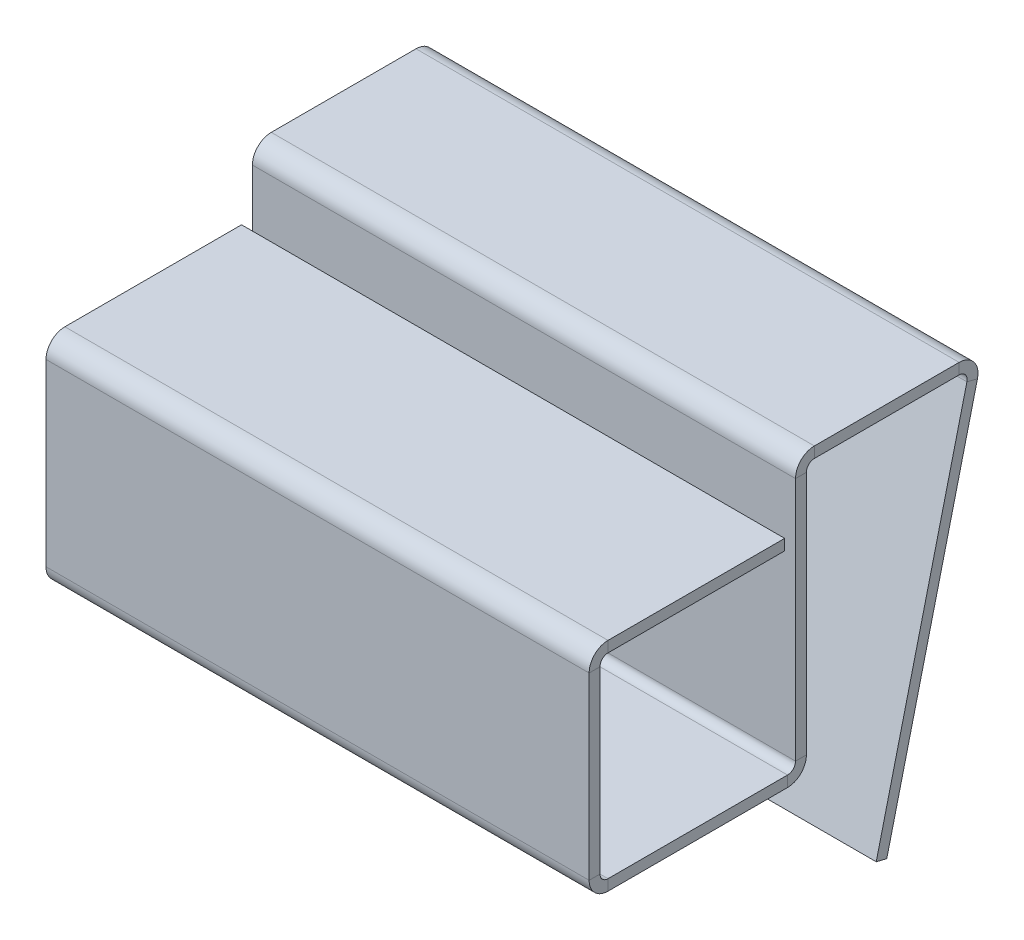
ISO-10303-21;
HEADER;
FILE_DESCRIPTION(('STEP AP214'),'2;1');
FILE_NAME('part.step','',(''),(''),'','','');
FILE_SCHEMA(('AUTOMOTIVE_DESIGN { 1 0 10303 214 1 1 1 1 }'));
ENDSEC;
DATA;
#1=APPLICATION_CONTEXT('core data for automotive mechanical design processes');
#2=APPLICATION_PROTOCOL_DEFINITION('international standard','automotive_design',2000,#1);
#3=PRODUCT_CONTEXT('',#1,'mechanical');
#4=PRODUCT('Part','Part','',(#3));
#5=PRODUCT_RELATED_PRODUCT_CATEGORY('part','',(#4));
#6=PRODUCT_DEFINITION_FORMATION('','',#4);
#7=PRODUCT_DEFINITION_CONTEXT('part definition',#1,'design');
#8=PRODUCT_DEFINITION('design','',#6,#7);
#9=PRODUCT_DEFINITION_SHAPE('','',#8);
#10=(LENGTH_UNIT() NAMED_UNIT(*) SI_UNIT(.MILLI.,.METRE.));
#11=(NAMED_UNIT(*) PLANE_ANGLE_UNIT() SI_UNIT($,.RADIAN.));
#12=(NAMED_UNIT(*) SI_UNIT($,.STERADIAN.) SOLID_ANGLE_UNIT());
#13=UNCERTAINTY_MEASURE_WITH_UNIT(LENGTH_MEASURE(1.E-05),#10,'distance_accuracy_value','');
#14=(GEOMETRIC_REPRESENTATION_CONTEXT(3) GLOBAL_UNCERTAINTY_ASSIGNED_CONTEXT((#13)) GLOBAL_UNIT_ASSIGNED_CONTEXT((#10,
#11,#12)) REPRESENTATION_CONTEXT('',''));
#15=CARTESIAN_POINT('',(0.,0.,0.));
#16=DIRECTION('',(0.,0.,1.));
#17=DIRECTION('',(1.,0.,0.));
#18=AXIS2_PLACEMENT_3D('',#15,#16,#17);
#19=CARTESIAN_POINT('',(50.,35.,-7.6326695579513));
#20=DIRECTION('',(1.,0.,0.));
#21=DIRECTION('',(0.,0.,-1.));
#22=AXIS2_PLACEMENT_3D('',#19,#20,#21);
#23=PLANE('',#22);
#24=DIRECTION('',(0.,1.,0.));
#25=VECTOR('',#24,1.);
#26=CARTESIAN_POINT('',(50.,35.,-7.6326695579513));
#27=LINE('',#26,#25);
#28=CARTESIAN_POINT('',(50.,35.,-7.6326695579513));
#29=VERTEX_POINT('',#28);
#30=CARTESIAN_POINT('',(50.,36.,-7.6326695579513));
#31=VERTEX_POINT('',#30);
#32=EDGE_CURVE('E11',#29,#31,#27,.T.);
#33=ORIENTED_EDGE('',*,*,#32,.F.);
#34=CARTESIAN_POINT('',(50.,34.2634,-7.6326695579513));
#35=DIRECTION('',(-1.,0.,0.));
#36=DIRECTION('',(0.,0.,1.));
#37=AXIS2_PLACEMENT_3D('',#34,#35,#36);
#38=CIRCLE('',#37,0.7366);
#39=CARTESIAN_POINT('',(50.,34.0881858939392,-8.34812715769941));
#40=VERTEX_POINT('',#39);
#41=EDGE_CURVE('E421',#40,#29,#38,.F.);
#42=ORIENTED_EDGE('',*,*,#41,.F.);
#43=DIRECTION('',(0.,0.237868729379253,0.971297311631974));
#44=VECTOR('',#43,1.);
#45=CARTESIAN_POINT('',(50.,33.85031716456,-9.31942446933138));
#46=LINE('',#45,#44);
#47=CARTESIAN_POINT('',(50.,33.85031716456,-9.31942446933138));
#48=VERTEX_POINT('',#47);
#49=EDGE_CURVE('E44',#48,#40,#46,.T.);
#50=ORIENTED_EDGE('',*,*,#49,.F.);
#51=CARTESIAN_POINT('',(50.,34.2634,-7.6326695579513));
#52=DIRECTION('',(1.,0.,0.));
#53=DIRECTION('',(0.,0.,-1.));
#54=AXIS2_PLACEMENT_3D('',#51,#52,#53);
#55=CIRCLE('',#54,1.7366);
#56=EDGE_CURVE('E434',#48,#31,#55,.T.);
#57=ORIENTED_EDGE('',*,*,#56,.T.);
#58=EDGE_LOOP('',(#33,#42,#50,#57));
#59=FACE_BOUND('',#58,.T.);
#60=ADVANCED_FACE('F36',(#59),#23,.T.);
#61=CARTESIAN_POINT('',(50.,33.85031716456,-9.31942446933138));
#62=DIRECTION('',(1.,0.,0.));
#63=DIRECTION('',(0.,0.,-1.));
#64=AXIS2_PLACEMENT_3D('',#61,#62,#63);
#65=PLANE('',#64);
#66=DIRECTION('',(0.,0.,1.));
#67=VECTOR('',#66,1.);
#68=CARTESIAN_POINT('',(50.,35.,-8.57142857142857));
#69=LINE('',#68,#67);
#70=CARTESIAN_POINT('',(50.,35.,5.69197142857143));
#71=VERTEX_POINT('',#70);
#72=EDGE_CURVE('E425',#29,#71,#69,.T.);
#73=ORIENTED_EDGE('',*,*,#72,.F.);
#74=ORIENTED_EDGE('',*,*,#32,.T.);
#75=DIRECTION('',(0.,0.,-1.));
#76=VECTOR('',#75,1.);
#77=CARTESIAN_POINT('',(50.,36.,-8.57142857142857));
#78=LINE('',#77,#76);
#79=CARTESIAN_POINT('',(50.,36.,5.69197142857143));
#80=VERTEX_POINT('',#79);
#81=EDGE_CURVE('E436',#31,#80,#78,.F.);
#82=ORIENTED_EDGE('',*,*,#81,.T.);
#83=DIRECTION('',(0.,-1.,0.));
#84=VECTOR('',#83,1.);
#85=CARTESIAN_POINT('',(50.,36.,5.69197142857143));
#86=LINE('',#85,#84);
#87=EDGE_CURVE('E395',#80,#71,#86,.T.);
#88=ORIENTED_EDGE('',*,*,#87,.T.);
#89=EDGE_LOOP('',(#73,#74,#82,#88));
#90=FACE_BOUND('',#89,.T.);
#91=ADVANCED_FACE('F517',(#90),#65,.T.);
#92=CARTESIAN_POINT('',(0.,34.0881858939392,-8.34812715769941));
#93=DIRECTION('',(-1.,0.,0.));
#94=DIRECTION('',(0.,0.,1.));
#95=AXIS2_PLACEMENT_3D('',#92,#93,#94);
#96=PLANE('',#95);
#97=DIRECTION('',(0.,-0.237868729379253,-0.971297311631974));
#98=VECTOR('',#97,1.);
#99=CARTESIAN_POINT('',(0.,34.0881858939392,-8.34812715769941));
#100=LINE('',#99,#98);
#101=CARTESIAN_POINT('',(0.,34.0881858939392,-8.34812715769941));
#102=VERTEX_POINT('',#101);
#103=CARTESIAN_POINT('',(0.,33.85031716456,-9.31942446933138));
#104=VERTEX_POINT('',#103);
#105=EDGE_CURVE('E401',#102,#104,#100,.T.);
#106=ORIENTED_EDGE('',*,*,#105,.F.);
#107=CARTESIAN_POINT('',(0.,34.2634,-7.6326695579513));
#108=DIRECTION('',(-1.,0.,0.));
#109=DIRECTION('',(0.,0.,1.));
#110=AXIS2_PLACEMENT_3D('',#107,#108,#109);
#111=CIRCLE('',#110,0.7366);
#112=CARTESIAN_POINT('',(0.,35.,-7.6326695579513));
#113=VERTEX_POINT('',#112);
#114=EDGE_CURVE('E279',#102,#113,#111,.F.);
#115=ORIENTED_EDGE('',*,*,#114,.T.);
#116=DIRECTION('',(0.,-1.,0.));
#117=VECTOR('',#116,1.);
#118=CARTESIAN_POINT('',(0.,36.,-7.6326695579513));
#119=LINE('',#118,#117);
#120=CARTESIAN_POINT('',(0.,36.,-7.6326695579513));
#121=VERTEX_POINT('',#120);
#122=EDGE_CURVE('E399',#121,#113,#119,.T.);
#123=ORIENTED_EDGE('',*,*,#122,.F.);
#124=CARTESIAN_POINT('',(0.,34.2634,-7.6326695579513));
#125=DIRECTION('',(1.,0.,0.));
#126=DIRECTION('',(0.,0.,-1.));
#127=AXIS2_PLACEMENT_3D('',#124,#125,#126);
#128=CIRCLE('',#127,1.7366);
#129=EDGE_CURVE('E291',#104,#121,#128,.T.);
#130=ORIENTED_EDGE('',*,*,#129,.F.);
#131=EDGE_LOOP('',(#106,#115,#123,#130));
#132=FACE_BOUND('',#131,.T.);
#133=ADVANCED_FACE('F576',(#132),#96,.T.);
#134=CARTESIAN_POINT('',(0.,36.,-7.6326695579513));
#135=DIRECTION('',(-1.,0.,0.));
#136=DIRECTION('',(0.,0.,1.));
#137=AXIS2_PLACEMENT_3D('',#134,#135,#136);
#138=PLANE('',#137);
#139=DIRECTION('',(0.,0.971297311631973,-0.237868729379259));
#140=VECTOR('',#139,1.);
#141=CARTESIAN_POINT('',(0.,0.,0.));
#142=LINE('',#141,#140);
#143=CARTESIAN_POINT('',(0.,0.,0.));
#144=VERTEX_POINT('',#143);
#145=EDGE_CURVE('E282',#144,#102,#142,.T.);
#146=ORIENTED_EDGE('',*,*,#145,.T.);
#147=ORIENTED_EDGE('',*,*,#105,.T.);
#148=DIRECTION('',(0.,0.971297311631973,-0.237868729379259));
#149=VECTOR('',#148,1.);
#150=CARTESIAN_POINT('',(0.,-0.237868729379259,-0.971297311631973));
#151=LINE('',#150,#149);
#152=CARTESIAN_POINT('',(0.,-0.237868729379259,-0.971297311631973));
#153=VERTEX_POINT('',#152);
#154=EDGE_CURVE('E288',#153,#104,#151,.T.);
#155=ORIENTED_EDGE('',*,*,#154,.F.);
#156=DIRECTION('',(0.,0.237868729379259,0.971297311631973));
#157=VECTOR('',#156,1.);
#158=CARTESIAN_POINT('',(0.,-0.237868729379259,-0.971297311631973));
#159=LINE('',#158,#157);
#160=EDGE_CURVE('E285',#153,#144,#159,.T.);
#161=ORIENTED_EDGE('',*,*,#160,.T.);
#162=EDGE_LOOP('',(#146,#147,#155,#161));
#163=FACE_BOUND('',#162,.T.);
#164=ADVANCED_FACE('F580',(#163),#138,.T.);
#165=CARTESIAN_POINT('',(50.,34.2634,6.42857142857143));
#166=DIRECTION('',(1.,0.,0.));
#167=DIRECTION('',(0.,0.,-1.));
#168=AXIS2_PLACEMENT_3D('',#165,#166,#167);
#169=PLANE('',#168);
#170=DIRECTION('',(0.,0.,1.));
#171=VECTOR('',#170,1.);
#172=CARTESIAN_POINT('',(50.,34.2634,6.42857142857143));
#173=LINE('',#172,#171);
#174=CARTESIAN_POINT('',(50.,34.2634,6.42857142857143));
#175=VERTEX_POINT('',#174);
#176=CARTESIAN_POINT('',(50.,34.2634,7.42857142857143));
#177=VERTEX_POINT('',#176);
#178=EDGE_CURVE('E397',#175,#177,#173,.T.);
#179=ORIENTED_EDGE('',*,*,#178,.F.);
#180=CARTESIAN_POINT('',(50.,34.2634,5.69197142857143));
#181=DIRECTION('',(-1.,0.,0.));
#182=DIRECTION('',(0.,0.,1.));
#183=AXIS2_PLACEMENT_3D('',#180,#181,#182);
#184=CIRCLE('',#183,0.7366);
#185=EDGE_CURVE('E507',#71,#175,#184,.F.);
#186=ORIENTED_EDGE('',*,*,#185,.F.);
#187=ORIENTED_EDGE('',*,*,#87,.F.);
#188=CARTESIAN_POINT('',(50.,34.2634,5.69197142857143));
#189=DIRECTION('',(1.,0.,0.));
#190=DIRECTION('',(0.,0.,-1.));
#191=AXIS2_PLACEMENT_3D('',#188,#189,#190);
#192=CIRCLE('',#191,1.7366);
#193=EDGE_CURVE('E439',#80,#177,#192,.T.);
#194=ORIENTED_EDGE('',*,*,#193,.T.);
#195=EDGE_LOOP('',(#179,#186,#187,#194));
#196=FACE_BOUND('',#195,.T.);
#197=ADVANCED_FACE('F524',(#196),#169,.T.);
#198=CARTESIAN_POINT('',(50.,36.,5.69197142857143));
#199=DIRECTION('',(1.,0.,0.));
#200=DIRECTION('',(0.,0.,-1.));
#201=AXIS2_PLACEMENT_3D('',#198,#199,#200);
#202=PLANE('',#201);
#203=DIRECTION('',(0.,-1.,0.));
#204=VECTOR('',#203,1.);
#205=CARTESIAN_POINT('',(50.,35.,6.42857142857143));
#206=LINE('',#205,#204);
#207=CARTESIAN_POINT('',(50.,11.7366,6.42857142857142));
#208=VERTEX_POINT('',#207);
#209=EDGE_CURVE('E504',#175,#208,#206,.T.);
#210=ORIENTED_EDGE('',*,*,#209,.F.);
#211=ORIENTED_EDGE('',*,*,#178,.T.);
#212=DIRECTION('',(0.,-1.,0.));
#213=VECTOR('',#212,1.);
#214=CARTESIAN_POINT('',(50.,35.,7.42857142857143));
#215=LINE('',#214,#213);
#216=CARTESIAN_POINT('',(50.,11.7366,7.42857142857142));
#217=VERTEX_POINT('',#216);
#218=EDGE_CURVE('E442',#177,#217,#215,.T.);
#219=ORIENTED_EDGE('',*,*,#218,.T.);
#220=DIRECTION('',(0.,0.,-1.));
#221=VECTOR('',#220,1.);
#222=CARTESIAN_POINT('',(50.,11.7366,7.42857142857142));
#223=LINE('',#222,#221);
#224=EDGE_CURVE('E387',#217,#208,#223,.T.);
#225=ORIENTED_EDGE('',*,*,#224,.T.);
#226=EDGE_LOOP('',(#210,#211,#219,#225));
#227=FACE_BOUND('',#226,.T.);
#228=ADVANCED_FACE('F533',(#227),#202,.T.);
#229=CARTESIAN_POINT('',(0.,35.,5.69197142857143));
#230=DIRECTION('',(-1.,0.,0.));
#231=DIRECTION('',(0.,0.,1.));
#232=AXIS2_PLACEMENT_3D('',#229,#230,#231);
#233=PLANE('',#232);
#234=DIRECTION('',(0.,1.,0.));
#235=VECTOR('',#234,1.);
#236=CARTESIAN_POINT('',(0.,35.,5.69197142857143));
#237=LINE('',#236,#235);
#238=CARTESIAN_POINT('',(0.,35.,5.69197142857143));
#239=VERTEX_POINT('',#238);
#240=CARTESIAN_POINT('',(0.,36.,5.69197142857143));
#241=VERTEX_POINT('',#240);
#242=EDGE_CURVE('E393',#239,#241,#237,.T.);
#243=ORIENTED_EDGE('',*,*,#242,.F.);
#244=CARTESIAN_POINT('',(0.,34.2634,5.69197142857143));
#245=DIRECTION('',(-1.,0.,0.));
#246=DIRECTION('',(0.,0.,1.));
#247=AXIS2_PLACEMENT_3D('',#244,#245,#246);
#248=CIRCLE('',#247,0.7366);
#249=CARTESIAN_POINT('',(0.,34.2634,6.42857142857143));
#250=VERTEX_POINT('',#249);
#251=EDGE_CURVE('E273',#239,#250,#248,.F.);
#252=ORIENTED_EDGE('',*,*,#251,.T.);
#253=DIRECTION('',(0.,0.,-1.));
#254=VECTOR('',#253,1.);
#255=CARTESIAN_POINT('',(0.,34.2634,7.42857142857143));
#256=LINE('',#255,#254);
#257=CARTESIAN_POINT('',(0.,34.2634,7.42857142857143));
#258=VERTEX_POINT('',#257);
#259=EDGE_CURVE('E391',#258,#250,#256,.T.);
#260=ORIENTED_EDGE('',*,*,#259,.F.);
#261=CARTESIAN_POINT('',(0.,34.2634,5.69197142857143));
#262=DIRECTION('',(1.,0.,0.));
#263=DIRECTION('',(0.,0.,-1.));
#264=AXIS2_PLACEMENT_3D('',#261,#262,#263);
#265=CIRCLE('',#264,1.7366);
#266=EDGE_CURVE('E297',#241,#258,#265,.T.);
#267=ORIENTED_EDGE('',*,*,#266,.F.);
#268=EDGE_LOOP('',(#243,#252,#260,#267));
#269=FACE_BOUND('',#268,.T.);
#270=ADVANCED_FACE('F591',(#269),#233,.T.);
#271=CARTESIAN_POINT('',(0.,34.2634,7.42857142857143));
#272=DIRECTION('',(-1.,0.,0.));
#273=DIRECTION('',(0.,0.,1.));
#274=AXIS2_PLACEMENT_3D('',#271,#272,#273);
#275=PLANE('',#274);
#276=DIRECTION('',(0.,0.,1.));
#277=VECTOR('',#276,1.);
#278=CARTESIAN_POINT('',(0.,35.,-8.57142857142857));
#279=LINE('',#278,#277);
#280=EDGE_CURVE('E276',#113,#239,#279,.T.);
#281=ORIENTED_EDGE('',*,*,#280,.T.);
#282=ORIENTED_EDGE('',*,*,#242,.T.);
#283=DIRECTION('',(0.,0.,-1.));
#284=VECTOR('',#283,1.);
#285=CARTESIAN_POINT('',(0.,36.,-8.57142857142857));
#286=LINE('',#285,#284);
#287=EDGE_CURVE('E294',#121,#241,#286,.F.);
#288=ORIENTED_EDGE('',*,*,#287,.F.);
#289=ORIENTED_EDGE('',*,*,#122,.T.);
#290=EDGE_LOOP('',(#281,#282,#288,#289));
#291=FACE_BOUND('',#290,.T.);
#292=ADVANCED_FACE('F594',(#291),#275,.T.);
#293=CARTESIAN_POINT('',(50.,10.,8.16517142857142));
#294=DIRECTION('',(1.,0.,0.));
#295=DIRECTION('',(0.,0.,-1.));
#296=AXIS2_PLACEMENT_3D('',#293,#294,#295);
#297=PLANE('',#296);
#298=DIRECTION('',(0.,1.,0.));
#299=VECTOR('',#298,1.);
#300=CARTESIAN_POINT('',(50.,10.,8.16517142857142));
#301=LINE('',#300,#299);
#302=CARTESIAN_POINT('',(50.,10.,8.16517142857142));
#303=VERTEX_POINT('',#302);
#304=CARTESIAN_POINT('',(50.,11.,8.16517142857142));
#305=VERTEX_POINT('',#304);
#306=EDGE_CURVE('E389',#303,#305,#301,.T.);
#307=ORIENTED_EDGE('',*,*,#306,.F.);
#308=CARTESIAN_POINT('',(50.,11.7366,8.16517142857142));
#309=DIRECTION('',(1.,0.,0.));
#310=DIRECTION('',(0.,0.,-1.));
#311=AXIS2_PLACEMENT_3D('',#308,#309,#310);
#312=CIRCLE('',#311,1.7366);
#313=EDGE_CURVE('E501',#208,#303,#312,.F.);
#314=ORIENTED_EDGE('',*,*,#313,.F.);
#315=ORIENTED_EDGE('',*,*,#224,.F.);
#316=CARTESIAN_POINT('',(50.,11.7366,8.16517142857142));
#317=DIRECTION('',(1.,0.,0.));
#318=DIRECTION('',(0.,0.,-1.));
#319=AXIS2_PLACEMENT_3D('',#316,#317,#318);
#320=CIRCLE('',#319,0.7366);
#321=EDGE_CURVE('E445',#217,#305,#320,.F.);
#322=ORIENTED_EDGE('',*,*,#321,.T.);
#323=EDGE_LOOP('',(#307,#314,#315,#322));
#324=FACE_BOUND('',#323,.T.);
#325=ADVANCED_FACE('F542',(#324),#297,.T.);
#326=CARTESIAN_POINT('',(50.,11.7366,7.42857142857142));
#327=DIRECTION('',(1.,0.,0.));
#328=DIRECTION('',(0.,0.,-1.));
#329=AXIS2_PLACEMENT_3D('',#326,#327,#328);
#330=PLANE('',#329);
#331=DIRECTION('',(0.,0.,1.));
#332=VECTOR('',#331,1.);
#333=CARTESIAN_POINT('',(50.,10.,6.42857142857142));
#334=LINE('',#333,#332);
#335=CARTESIAN_POINT('',(50.,10.,24.6919714285714));
#336=VERTEX_POINT('',#335);
#337=EDGE_CURVE('E498',#303,#336,#334,.T.);
#338=ORIENTED_EDGE('',*,*,#337,.F.);
#339=ORIENTED_EDGE('',*,*,#306,.T.);
#340=DIRECTION('',(0.,0.,1.));
#341=VECTOR('',#340,1.);
#342=CARTESIAN_POINT('',(50.,11.,6.42857142857142));
#343=LINE('',#342,#341);
#344=CARTESIAN_POINT('',(50.,11.,24.6919714285714));
#345=VERTEX_POINT('',#344);
#346=EDGE_CURVE('E227',#305,#345,#343,.T.);
#347=ORIENTED_EDGE('',*,*,#346,.T.);
#348=DIRECTION('',(0.,-1.,0.));
#349=VECTOR('',#348,1.);
#350=CARTESIAN_POINT('',(50.,11.,24.6919714285714));
#351=LINE('',#350,#349);
#352=EDGE_CURVE('E218',#345,#336,#351,.T.);
#353=ORIENTED_EDGE('',*,*,#352,.T.);
#354=EDGE_LOOP('',(#338,#339,#347,#353));
#355=FACE_BOUND('',#354,.T.);
#356=ADVANCED_FACE('F451',(#355),#330,.T.);
#357=CARTESIAN_POINT('',(0.,11.7366,6.42857142857142));
#358=DIRECTION('',(-1.,0.,0.));
#359=DIRECTION('',(0.,0.,1.));
#360=AXIS2_PLACEMENT_3D('',#357,#358,#359);
#361=PLANE('',#360);
#362=DIRECTION('',(0.,0.,1.));
#363=VECTOR('',#362,1.);
#364=CARTESIAN_POINT('',(0.,11.7366,6.42857142857142));
#365=LINE('',#364,#363);
#366=CARTESIAN_POINT('',(0.,11.7366,6.42857142857142));
#367=VERTEX_POINT('',#366);
#368=CARTESIAN_POINT('',(0.,11.7366,7.42857142857142));
#369=VERTEX_POINT('',#368);
#370=EDGE_CURVE('E385',#367,#369,#365,.T.);
#371=ORIENTED_EDGE('',*,*,#370,.F.);
#372=CARTESIAN_POINT('',(0.,11.7366,8.16517142857142));
#373=DIRECTION('',(1.,0.,0.));
#374=DIRECTION('',(0.,0.,-1.));
#375=AXIS2_PLACEMENT_3D('',#372,#373,#374);
#376=CIRCLE('',#375,1.7366);
#377=CARTESIAN_POINT('',(0.,10.,8.16517142857142));
#378=VERTEX_POINT('',#377);
#379=EDGE_CURVE('E267',#367,#378,#376,.F.);
#380=ORIENTED_EDGE('',*,*,#379,.T.);
#381=DIRECTION('',(0.,-1.,0.));
#382=VECTOR('',#381,1.);
#383=CARTESIAN_POINT('',(0.,11.,8.16517142857142));
#384=LINE('',#383,#382);
#385=CARTESIAN_POINT('',(0.,11.,8.16517142857142));
#386=VERTEX_POINT('',#385);
#387=EDGE_CURVE('E217',#386,#378,#384,.T.);
#388=ORIENTED_EDGE('',*,*,#387,.F.);
#389=CARTESIAN_POINT('',(0.,11.7366,8.16517142857142));
#390=DIRECTION('',(1.,0.,0.));
#391=DIRECTION('',(0.,0.,-1.));
#392=AXIS2_PLACEMENT_3D('',#389,#390,#391);
#393=CIRCLE('',#392,0.7366);
#394=EDGE_CURVE('E303',#369,#386,#393,.F.);
#395=ORIENTED_EDGE('',*,*,#394,.F.);
#396=EDGE_LOOP('',(#371,#380,#388,#395));
#397=FACE_BOUND('',#396,.T.);
#398=ADVANCED_FACE('F551',(#397),#361,.T.);
#399=CARTESIAN_POINT('',(0.,11.,8.16517142857142));
#400=DIRECTION('',(-1.,0.,0.));
#401=DIRECTION('',(0.,0.,1.));
#402=AXIS2_PLACEMENT_3D('',#399,#400,#401);
#403=PLANE('',#402);
#404=DIRECTION('',(0.,-1.,0.));
#405=VECTOR('',#404,1.);
#406=CARTESIAN_POINT('',(0.,35.,6.42857142857143));
#407=LINE('',#406,#405);
#408=EDGE_CURVE('E270',#250,#367,#407,.T.);
#409=ORIENTED_EDGE('',*,*,#408,.T.);
#410=ORIENTED_EDGE('',*,*,#370,.T.);
#411=DIRECTION('',(0.,-1.,0.));
#412=VECTOR('',#411,1.);
#413=CARTESIAN_POINT('',(0.,35.,7.42857142857143));
#414=LINE('',#413,#412);
#415=EDGE_CURVE('E300',#258,#369,#414,.T.);
#416=ORIENTED_EDGE('',*,*,#415,.F.);
#417=ORIENTED_EDGE('',*,*,#259,.T.);
#418=EDGE_LOOP('',(#409,#410,#416,#417));
#419=FACE_BOUND('',#418,.T.);
#420=ADVANCED_FACE('F555',(#419),#403,.T.);
#421=CARTESIAN_POINT('',(50.,11.7366,26.4285714285714));
#422=DIRECTION('',(1.,0.,0.));
#423=DIRECTION('',(0.,0.,-1.));
#424=AXIS2_PLACEMENT_3D('',#421,#422,#423);
#425=PLANE('',#424);
#426=DIRECTION('',(0.,0.,-1.));
#427=VECTOR('',#426,1.);
#428=CARTESIAN_POINT('',(50.,11.7366,26.4285714285714));
#429=LINE('',#428,#427);
#430=CARTESIAN_POINT('',(50.,11.7366,26.4285714285714));
#431=VERTEX_POINT('',#430);
#432=CARTESIAN_POINT('',(50.,11.7366,25.4285714285714));
#433=VERTEX_POINT('',#432);
#434=EDGE_CURVE('E205',#431,#433,#429,.T.);
#435=ORIENTED_EDGE('',*,*,#434,.F.);
#436=CARTESIAN_POINT('',(50.,11.7366,24.6919714285714));
#437=DIRECTION('',(1.,0.,0.));
#438=DIRECTION('',(0.,0.,-1.));
#439=AXIS2_PLACEMENT_3D('',#436,#437,#438);
#440=CIRCLE('',#439,1.7366);
#441=EDGE_CURVE('E463',#336,#431,#440,.F.);
#442=ORIENTED_EDGE('',*,*,#441,.F.);
#443=ORIENTED_EDGE('',*,*,#352,.F.);
#444=CARTESIAN_POINT('',(50.,11.7366,24.6919714285714));
#445=DIRECTION('',(1.,0.,0.));
#446=DIRECTION('',(0.,0.,-1.));
#447=AXIS2_PLACEMENT_3D('',#444,#445,#446);
#448=CIRCLE('',#447,0.7366);
#449=EDGE_CURVE('E221',#345,#433,#448,.F.);
#450=ORIENTED_EDGE('',*,*,#449,.T.);
#451=EDGE_LOOP('',(#435,#442,#443,#450));
#452=FACE_BOUND('',#451,.T.);
#453=ADVANCED_FACE('F223',(#452),#425,.T.);
#454=CARTESIAN_POINT('',(50.,11.,24.6919714285714));
#455=DIRECTION('',(1.,0.,0.));
#456=DIRECTION('',(0.,0.,-1.));
#457=AXIS2_PLACEMENT_3D('',#454,#455,#456);
#458=PLANE('',#457);
#459=DIRECTION('',(0.,1.,0.));
#460=VECTOR('',#459,1.);
#461=CARTESIAN_POINT('',(50.,10.,26.4285714285714));
#462=LINE('',#461,#460);
#463=CARTESIAN_POINT('',(50.,28.2634,26.4285714285714));
#464=VERTEX_POINT('',#463);
#465=EDGE_CURVE('E212',#431,#464,#462,.T.);
#466=ORIENTED_EDGE('',*,*,#465,.F.);
#467=ORIENTED_EDGE('',*,*,#434,.T.);
#468=DIRECTION('',(0.,1.,0.));
#469=VECTOR('',#468,1.);
#470=CARTESIAN_POINT('',(50.,10.,25.4285714285714));
#471=LINE('',#470,#469);
#472=CARTESIAN_POINT('',(50.,28.2634,25.4285714285714));
#473=VERTEX_POINT('',#472);
#474=EDGE_CURVE('E209',#433,#473,#471,.T.);
#475=ORIENTED_EDGE('',*,*,#474,.T.);
#476=DIRECTION('',(0.,0.,1.));
#477=VECTOR('',#476,1.);
#478=CARTESIAN_POINT('',(50.,28.2634,25.4285714285714));
#479=LINE('',#478,#477);
#480=EDGE_CURVE('E376',#473,#464,#479,.T.);
#481=ORIENTED_EDGE('',*,*,#480,.T.);
#482=EDGE_LOOP('',(#466,#467,#475,#481));
#483=FACE_BOUND('',#482,.T.);
#484=ADVANCED_FACE('F207',(#483),#458,.T.);
#485=CARTESIAN_POINT('',(0.,10.,24.6919714285714));
#486=DIRECTION('',(-1.,0.,0.));
#487=DIRECTION('',(0.,0.,1.));
#488=AXIS2_PLACEMENT_3D('',#485,#486,#487);
#489=PLANE('',#488);
#490=DIRECTION('',(0.,1.,0.));
#491=VECTOR('',#490,1.);
#492=CARTESIAN_POINT('',(0.,10.,24.6919714285714));
#493=LINE('',#492,#491);
#494=CARTESIAN_POINT('',(0.,10.,24.6919714285714));
#495=VERTEX_POINT('',#494);
#496=CARTESIAN_POINT('',(0.,11.,24.6919714285714));
#497=VERTEX_POINT('',#496);
#498=EDGE_CURVE('E381',#495,#497,#493,.T.);
#499=ORIENTED_EDGE('',*,*,#498,.F.);
#500=CARTESIAN_POINT('',(0.,11.7366,24.6919714285714));
#501=DIRECTION('',(1.,0.,0.));
#502=DIRECTION('',(0.,0.,-1.));
#503=AXIS2_PLACEMENT_3D('',#500,#501,#502);
#504=CIRCLE('',#503,1.7366);
#505=CARTESIAN_POINT('',(0.,11.7366,26.4285714285714));
#506=VERTEX_POINT('',#505);
#507=EDGE_CURVE('E261',#495,#506,#504,.F.);
#508=ORIENTED_EDGE('',*,*,#507,.T.);
#509=DIRECTION('',(0.,0.,1.));
#510=VECTOR('',#509,1.);
#511=CARTESIAN_POINT('',(0.,11.7366,25.4285714285714));
#512=LINE('',#511,#510);
#513=CARTESIAN_POINT('',(0.,11.7366,25.4285714285714));
#514=VERTEX_POINT('',#513);
#515=EDGE_CURVE('E379',#514,#506,#512,.T.);
#516=ORIENTED_EDGE('',*,*,#515,.F.);
#517=CARTESIAN_POINT('',(0.,11.7366,24.6919714285714));
#518=DIRECTION('',(1.,0.,0.));
#519=DIRECTION('',(0.,0.,-1.));
#520=AXIS2_PLACEMENT_3D('',#517,#518,#519);
#521=CIRCLE('',#520,0.7366);
#522=EDGE_CURVE('E234',#497,#514,#521,.F.);
#523=ORIENTED_EDGE('',*,*,#522,.F.);
#524=EDGE_LOOP('',(#499,#508,#516,#523));
#525=FACE_BOUND('',#524,.T.);
#526=ADVANCED_FACE('F457',(#525),#489,.T.);
#527=CARTESIAN_POINT('',(0.,11.7366,25.4285714285714));
#528=DIRECTION('',(-1.,0.,0.));
#529=DIRECTION('',(0.,0.,1.));
#530=AXIS2_PLACEMENT_3D('',#527,#528,#529);
#531=PLANE('',#530);
#532=DIRECTION('',(0.,0.,1.));
#533=VECTOR('',#532,1.);
#534=CARTESIAN_POINT('',(0.,10.,6.42857142857142));
#535=LINE('',#534,#533);
#536=EDGE_CURVE('E264',#378,#495,#535,.T.);
#537=ORIENTED_EDGE('',*,*,#536,.T.);
#538=ORIENTED_EDGE('',*,*,#498,.T.);
#539=DIRECTION('',(0.,0.,1.));
#540=VECTOR('',#539,1.);
#541=CARTESIAN_POINT('',(0.,11.,6.42857142857142));
#542=LINE('',#541,#540);
#543=EDGE_CURVE('E306',#386,#497,#542,.T.);
#544=ORIENTED_EDGE('',*,*,#543,.F.);
#545=ORIENTED_EDGE('',*,*,#387,.T.);
#546=EDGE_LOOP('',(#537,#538,#544,#545));
#547=FACE_BOUND('',#546,.T.);
#548=ADVANCED_FACE('F560',(#547),#531,.T.);
#549=CARTESIAN_POINT('',(50.,30.,24.6919714285714));
#550=DIRECTION('',(1.,0.,0.));
#551=DIRECTION('',(0.,0.,-1.));
#552=AXIS2_PLACEMENT_3D('',#549,#550,#551);
#553=PLANE('',#552);
#554=DIRECTION('',(0.,-1.,0.));
#555=VECTOR('',#554,1.);
#556=CARTESIAN_POINT('',(50.,30.,24.6919714285714));
#557=LINE('',#556,#555);
#558=CARTESIAN_POINT('',(50.,30.,24.6919714285714));
#559=VERTEX_POINT('',#558);
#560=CARTESIAN_POINT('',(50.,29.,24.6919714285714));
#561=VERTEX_POINT('',#560);
#562=EDGE_CURVE('E52',#559,#561,#557,.T.);
#563=ORIENTED_EDGE('',*,*,#562,.F.);
#564=CARTESIAN_POINT('',(50.,28.2634,24.6919714285714));
#565=DIRECTION('',(1.,0.,0.));
#566=DIRECTION('',(0.,0.,-1.));
#567=AXIS2_PLACEMENT_3D('',#564,#565,#566);
#568=CIRCLE('',#567,1.7366);
#569=EDGE_CURVE('E491',#464,#559,#568,.F.);
#570=ORIENTED_EDGE('',*,*,#569,.F.);
#571=ORIENTED_EDGE('',*,*,#480,.F.);
#572=CARTESIAN_POINT('',(50.,28.2634,24.6919714285714));
#573=DIRECTION('',(1.,0.,0.));
#574=DIRECTION('',(0.,0.,-1.));
#575=AXIS2_PLACEMENT_3D('',#572,#573,#574);
#576=CIRCLE('',#575,0.7366);
#577=EDGE_CURVE('E242',#473,#561,#576,.F.);
#578=ORIENTED_EDGE('',*,*,#577,.T.);
#579=EDGE_LOOP('',(#563,#570,#571,#578));
#580=FACE_BOUND('',#579,.T.);
#581=ADVANCED_FACE('F562',(#580),#553,.T.);
#582=CARTESIAN_POINT('',(50.,28.2634,25.4285714285714));
#583=DIRECTION('',(1.,0.,0.));
#584=DIRECTION('',(0.,0.,-1.));
#585=AXIS2_PLACEMENT_3D('',#582,#583,#584);
#586=PLANE('',#585);
#587=DIRECTION('',(0.,0.,-1.));
#588=VECTOR('',#587,1.);
#589=CARTESIAN_POINT('',(50.,30.,26.4285714285714));
#590=LINE('',#589,#588);
#591=CARTESIAN_POINT('',(50.,30.,8.42857142857142));
#592=VERTEX_POINT('',#591);
#593=EDGE_CURVE('E489',#559,#592,#590,.T.);
#594=ORIENTED_EDGE('',*,*,#593,.F.);
#595=ORIENTED_EDGE('',*,*,#562,.T.);
#596=DIRECTION('',(0.,0.,-1.));
#597=VECTOR('',#596,1.);
#598=CARTESIAN_POINT('',(50.,29.,26.4285714285714));
#599=LINE('',#598,#597);
#600=CARTESIAN_POINT('',(50.,29.,8.42857142857142));
#601=VERTEX_POINT('',#600);
#602=EDGE_CURVE('E142',#561,#601,#599,.T.);
#603=ORIENTED_EDGE('',*,*,#602,.T.);
#604=DIRECTION('',(0.,-1.,0.));
#605=VECTOR('',#604,1.);
#606=CARTESIAN_POINT('',(50.,30.,8.42857142857142));
#607=LINE('',#606,#605);
#608=EDGE_CURVE('E487',#592,#601,#607,.T.);
#609=ORIENTED_EDGE('',*,*,#608,.F.);
#610=EDGE_LOOP('',(#594,#595,#603,#609));
#611=FACE_BOUND('',#610,.T.);
#612=ADVANCED_FACE('F568',(#611),#586,.T.);
#613=CARTESIAN_POINT('',(0.,28.2634,26.4285714285714));
#614=DIRECTION('',(-1.,0.,0.));
#615=DIRECTION('',(0.,0.,1.));
#616=AXIS2_PLACEMENT_3D('',#613,#614,#615);
#617=PLANE('',#616);
#618=DIRECTION('',(0.,0.,-1.));
#619=VECTOR('',#618,1.);
#620=CARTESIAN_POINT('',(0.,28.2634,26.4285714285714));
#621=LINE('',#620,#619);
#622=CARTESIAN_POINT('',(0.,28.2634,26.4285714285714));
#623=VERTEX_POINT('',#622);
#624=CARTESIAN_POINT('',(0.,28.2634,25.4285714285714));
#625=VERTEX_POINT('',#624);
#626=EDGE_CURVE('E129',#623,#625,#621,.T.);
#627=ORIENTED_EDGE('',*,*,#626,.F.);
#628=CARTESIAN_POINT('',(0.,28.2634,24.6919714285714));
#629=DIRECTION('',(1.,0.,0.));
#630=DIRECTION('',(0.,0.,-1.));
#631=AXIS2_PLACEMENT_3D('',#628,#629,#630);
#632=CIRCLE('',#631,1.7366);
#633=CARTESIAN_POINT('',(0.,30.,24.6919714285714));
#634=VERTEX_POINT('',#633);
#635=EDGE_CURVE('E257',#623,#634,#632,.F.);
#636=ORIENTED_EDGE('',*,*,#635,.T.);
#637=DIRECTION('',(0.,1.,0.));
#638=VECTOR('',#637,1.);
#639=CARTESIAN_POINT('',(0.,29.,24.6919714285714));
#640=LINE('',#639,#638);
#641=CARTESIAN_POINT('',(0.,29.,24.6919714285714));
#642=VERTEX_POINT('',#641);
#643=EDGE_CURVE('E136',#642,#634,#640,.T.);
#644=ORIENTED_EDGE('',*,*,#643,.F.);
#645=CARTESIAN_POINT('',(0.,28.2634,24.6919714285714));
#646=DIRECTION('',(1.,0.,0.));
#647=DIRECTION('',(0.,0.,-1.));
#648=AXIS2_PLACEMENT_3D('',#645,#646,#647);
#649=CIRCLE('',#648,0.7366);
#650=EDGE_CURVE('E312',#625,#642,#649,.F.);
#651=ORIENTED_EDGE('',*,*,#650,.F.);
#652=EDGE_LOOP('',(#627,#636,#644,#651));
#653=FACE_BOUND('',#652,.T.);
#654=ADVANCED_FACE('F474',(#653),#617,.T.);
#655=CARTESIAN_POINT('',(0.,29.,24.6919714285714));
#656=DIRECTION('',(-1.,0.,0.));
#657=DIRECTION('',(0.,0.,1.));
#658=AXIS2_PLACEMENT_3D('',#655,#656,#657);
#659=PLANE('',#658);
#660=DIRECTION('',(0.,1.,0.));
#661=VECTOR('',#660,1.);
#662=CARTESIAN_POINT('',(0.,10.,26.4285714285714));
#663=LINE('',#662,#661);
#664=EDGE_CURVE('E259',#506,#623,#663,.T.);
#665=ORIENTED_EDGE('',*,*,#664,.T.);
#666=ORIENTED_EDGE('',*,*,#626,.T.);
#667=DIRECTION('',(0.,1.,0.));
#668=VECTOR('',#667,1.);
#669=CARTESIAN_POINT('',(0.,10.,25.4285714285714));
#670=LINE('',#669,#668);
#671=EDGE_CURVE('E310',#514,#625,#670,.T.);
#672=ORIENTED_EDGE('',*,*,#671,.F.);
#673=ORIENTED_EDGE('',*,*,#515,.T.);
#674=EDGE_LOOP('',(#665,#666,#672,#673));
#675=FACE_BOUND('',#674,.T.);
#676=ADVANCED_FACE('F459',(#675),#659,.T.);
#677=CARTESIAN_POINT('',(50.,29.,26.4285714285714));
#678=DIRECTION('',(0.,1.,0.));
#679=DIRECTION('',(0.,0.,1.));
#680=AXIS2_PLACEMENT_3D('',#677,#678,#679);
#681=PLANE('',#680);
#682=DIRECTION('',(0.,0.,-1.));
#683=VECTOR('',#682,1.);
#684=CARTESIAN_POINT('',(0.,29.,26.4285714285714));
#685=LINE('',#684,#683);
#686=CARTESIAN_POINT('',(0.,29.,8.42857142857142));
#687=VERTEX_POINT('',#686);
#688=EDGE_CURVE('E248',#642,#687,#685,.T.);
#689=ORIENTED_EDGE('',*,*,#688,.T.);
#690=DIRECTION('',(-1.,0.,0.));
#691=VECTOR('',#690,1.);
#692=CARTESIAN_POINT('',(50.,29.,8.42857142857142));
#693=LINE('',#692,#691);
#694=EDGE_CURVE('E372',#601,#687,#693,.T.);
#695=ORIENTED_EDGE('',*,*,#694,.F.);
#696=ORIENTED_EDGE('',*,*,#602,.F.);
#697=DIRECTION('',(-1.,0.,0.));
#698=VECTOR('',#697,1.);
#699=CARTESIAN_POINT('',(50.,29.,24.6919714285714));
#700=LINE('',#699,#698);
#701=EDGE_CURVE('E244',#561,#642,#700,.T.);
#702=ORIENTED_EDGE('',*,*,#701,.T.);
#703=EDGE_LOOP('',(#689,#695,#696,#702));
#704=FACE_BOUND('',#703,.T.);
#705=ADVANCED_FACE('F480',(#704),#681,.F.);
#706=CARTESIAN_POINT('',(50.,30.,8.42857142857142));
#707=DIRECTION('',(0.,0.,-1.));
#708=DIRECTION('',(-1.,0.,0.));
#709=AXIS2_PLACEMENT_3D('',#706,#707,#708);
#710=PLANE('',#709);
#711=DIRECTION('',(0.,-1.,0.));
#712=VECTOR('',#711,1.);
#713=CARTESIAN_POINT('',(0.,30.,8.42857142857142));
#714=LINE('',#713,#712);
#715=CARTESIAN_POINT('',(0.,30.,8.42857142857142));
#716=VERTEX_POINT('',#715);
#717=EDGE_CURVE('E251',#716,#687,#714,.T.);
#718=ORIENTED_EDGE('',*,*,#717,.F.);
#719=DIRECTION('',(-1.,0.,0.));
#720=VECTOR('',#719,1.);
#721=CARTESIAN_POINT('',(50.,30.,8.42857142857142));
#722=LINE('',#721,#720);
#723=EDGE_CURVE('E370',#592,#716,#722,.T.);
#724=ORIENTED_EDGE('',*,*,#723,.F.);
#725=ORIENTED_EDGE('',*,*,#608,.T.);
#726=ORIENTED_EDGE('',*,*,#694,.T.);
#727=EDGE_LOOP('',(#718,#724,#725,#726));
#728=FACE_BOUND('',#727,.T.);
#729=ADVANCED_FACE('F485',(#728),#710,.T.);
#730=CARTESIAN_POINT('',(50.,30.,26.4285714285714));
#731=DIRECTION('',(0.,1.,0.));
#732=DIRECTION('',(0.,0.,1.));
#733=AXIS2_PLACEMENT_3D('',#730,#731,#732);
#734=PLANE('',#733);
#735=DIRECTION('',(0.,0.,-1.));
#736=VECTOR('',#735,1.);
#737=CARTESIAN_POINT('',(0.,30.,26.4285714285714));
#738=LINE('',#737,#736);
#739=EDGE_CURVE('E254',#634,#716,#738,.T.);
#740=ORIENTED_EDGE('',*,*,#739,.F.);
#741=DIRECTION('',(-1.,0.,0.));
#742=VECTOR('',#741,1.);
#743=CARTESIAN_POINT('',(50.,30.,24.6919714285714));
#744=LINE('',#743,#742);
#745=EDGE_CURVE('E367',#559,#634,#744,.T.);
#746=ORIENTED_EDGE('',*,*,#745,.F.);
#747=ORIENTED_EDGE('',*,*,#593,.T.);
#748=ORIENTED_EDGE('',*,*,#723,.T.);
#749=EDGE_LOOP('',(#740,#746,#747,#748));
#750=FACE_BOUND('',#749,.T.);
#751=ADVANCED_FACE('F676',(#750),#734,.T.);
#752=CARTESIAN_POINT('',(50.,28.2634,24.6919714285714));
#753=DIRECTION('',(-1.,0.,0.));
#754=DIRECTION('',(0.,0.,1.));
#755=AXIS2_PLACEMENT_3D('',#752,#753,#754);
#756=CYLINDRICAL_SURFACE('',#755,1.7366);
#757=ORIENTED_EDGE('',*,*,#635,.F.);
#758=DIRECTION('',(-1.,0.,0.));
#759=VECTOR('',#758,1.);
#760=CARTESIAN_POINT('',(50.,28.2634,26.4285714285714));
#761=LINE('',#760,#759);
#762=EDGE_CURVE('E364',#464,#623,#761,.T.);
#763=ORIENTED_EDGE('',*,*,#762,.F.);
#764=ORIENTED_EDGE('',*,*,#569,.T.);
#765=ORIENTED_EDGE('',*,*,#745,.T.);
#766=EDGE_LOOP('',(#757,#763,#764,#765));
#767=FACE_BOUND('',#766,.T.);
#768=ADVANCED_FACE('F471',(#767),#756,.T.);
#769=CARTESIAN_POINT('',(50.,10.,26.4285714285714));
#770=DIRECTION('',(0.,0.,1.));
#771=DIRECTION('',(1.,0.,0.));
#772=AXIS2_PLACEMENT_3D('',#769,#770,#771);
#773=PLANE('',#772);
#774=ORIENTED_EDGE('',*,*,#664,.F.);
#775=DIRECTION('',(-1.,0.,0.));
#776=VECTOR('',#775,1.);
#777=CARTESIAN_POINT('',(50.,11.7366,26.4285714285714));
#778=LINE('',#777,#776);
#779=EDGE_CURVE('E361',#431,#506,#778,.T.);
#780=ORIENTED_EDGE('',*,*,#779,.F.);
#781=ORIENTED_EDGE('',*,*,#465,.T.);
#782=ORIENTED_EDGE('',*,*,#762,.T.);
#783=EDGE_LOOP('',(#774,#780,#781,#782));
#784=FACE_BOUND('',#783,.T.);
#785=ADVANCED_FACE('F465',(#784),#773,.T.);
#786=CARTESIAN_POINT('',(50.,11.7366,24.6919714285714));
#787=DIRECTION('',(-1.,0.,0.));
#788=DIRECTION('',(0.,0.,1.));
#789=AXIS2_PLACEMENT_3D('',#786,#787,#788);
#790=CYLINDRICAL_SURFACE('',#789,1.7366);
#791=ORIENTED_EDGE('',*,*,#507,.F.);
#792=DIRECTION('',(-1.,0.,0.));
#793=VECTOR('',#792,1.);
#794=CARTESIAN_POINT('',(50.,10.,24.6919714285714));
#795=LINE('',#794,#793);
#796=EDGE_CURVE('E358',#336,#495,#795,.T.);
#797=ORIENTED_EDGE('',*,*,#796,.F.);
#798=ORIENTED_EDGE('',*,*,#441,.T.);
#799=ORIENTED_EDGE('',*,*,#779,.T.);
#800=EDGE_LOOP('',(#791,#797,#798,#799));
#801=FACE_BOUND('',#800,.T.);
#802=ADVANCED_FACE('F462',(#801),#790,.T.);
#803=CARTESIAN_POINT('',(50.,10.,6.42857142857142));
#804=DIRECTION('',(0.,-1.,0.));
#805=DIRECTION('',(0.,0.,-1.));
#806=AXIS2_PLACEMENT_3D('',#803,#804,#805);
#807=PLANE('',#806);
#808=ORIENTED_EDGE('',*,*,#536,.F.);
#809=DIRECTION('',(-1.,0.,0.));
#810=VECTOR('',#809,1.);
#811=CARTESIAN_POINT('',(50.,10.,8.16517142857142));
#812=LINE('',#811,#810);
#813=EDGE_CURVE('E355',#303,#378,#812,.T.);
#814=ORIENTED_EDGE('',*,*,#813,.F.);
#815=ORIENTED_EDGE('',*,*,#337,.T.);
#816=ORIENTED_EDGE('',*,*,#796,.T.);
#817=EDGE_LOOP('',(#808,#814,#815,#816));
#818=FACE_BOUND('',#817,.T.);
#819=ADVANCED_FACE('F548',(#818),#807,.T.);
#820=CARTESIAN_POINT('',(50.,11.7366,8.16517142857142));
#821=DIRECTION('',(-1.,0.,0.));
#822=DIRECTION('',(0.,0.,1.));
#823=AXIS2_PLACEMENT_3D('',#820,#821,#822);
#824=CYLINDRICAL_SURFACE('',#823,1.7366);
#825=ORIENTED_EDGE('',*,*,#379,.F.);
#826=DIRECTION('',(-1.,0.,0.));
#827=VECTOR('',#826,1.);
#828=CARTESIAN_POINT('',(50.,11.7366,6.42857142857142));
#829=LINE('',#828,#827);
#830=EDGE_CURVE('E352',#208,#367,#829,.T.);
#831=ORIENTED_EDGE('',*,*,#830,.F.);
#832=ORIENTED_EDGE('',*,*,#313,.T.);
#833=ORIENTED_EDGE('',*,*,#813,.T.);
#834=EDGE_LOOP('',(#825,#831,#832,#833));
#835=FACE_BOUND('',#834,.T.);
#836=ADVANCED_FACE('F541',(#835),#824,.T.);
#837=CARTESIAN_POINT('',(50.,35.,6.42857142857143));
#838=DIRECTION('',(0.,0.,-1.));
#839=DIRECTION('',(0.,1.,0.));
#840=AXIS2_PLACEMENT_3D('',#837,#838,#839);
#841=PLANE('',#840);
#842=ORIENTED_EDGE('',*,*,#408,.F.);
#843=DIRECTION('',(-1.,0.,0.));
#844=VECTOR('',#843,1.);
#845=CARTESIAN_POINT('',(50.,34.2634,6.42857142857143));
#846=LINE('',#845,#844);
#847=EDGE_CURVE('E349',#175,#250,#846,.T.);
#848=ORIENTED_EDGE('',*,*,#847,.F.);
#849=ORIENTED_EDGE('',*,*,#209,.T.);
#850=ORIENTED_EDGE('',*,*,#830,.T.);
#851=EDGE_LOOP('',(#842,#848,#849,#850));
#852=FACE_BOUND('',#851,.T.);
#853=ADVANCED_FACE('F532',(#852),#841,.T.);
#854=CARTESIAN_POINT('',(50.,34.2634,5.69197142857143));
#855=DIRECTION('',(-1.,0.,0.));
#856=DIRECTION('',(0.,0.,1.));
#857=AXIS2_PLACEMENT_3D('',#854,#855,#856);
#858=CYLINDRICAL_SURFACE('',#857,0.7366);
#859=ORIENTED_EDGE('',*,*,#251,.F.);
#860=DIRECTION('',(-1.,0.,0.));
#861=VECTOR('',#860,1.);
#862=CARTESIAN_POINT('',(50.,35.,5.69197142857143));
#863=LINE('',#862,#861);
#864=EDGE_CURVE('E346',#71,#239,#863,.T.);
#865=ORIENTED_EDGE('',*,*,#864,.F.);
#866=ORIENTED_EDGE('',*,*,#185,.T.);
#867=ORIENTED_EDGE('',*,*,#847,.T.);
#868=EDGE_LOOP('',(#859,#865,#866,#867));
#869=FACE_BOUND('',#868,.T.);
#870=ADVANCED_FACE('F523',(#869),#858,.F.);
#871=CARTESIAN_POINT('',(50.,35.,-8.57142857142857));
#872=DIRECTION('',(0.,-1.,0.));
#873=DIRECTION('',(0.,0.,-1.));
#874=AXIS2_PLACEMENT_3D('',#871,#872,#873);
#875=PLANE('',#874);
#876=ORIENTED_EDGE('',*,*,#280,.F.);
#877=DIRECTION('',(-1.,0.,0.));
#878=VECTOR('',#877,1.);
#879=CARTESIAN_POINT('',(50.,35.,-7.6326695579513));
#880=LINE('',#879,#878);
#881=EDGE_CURVE('E343',#29,#113,#880,.T.);
#882=ORIENTED_EDGE('',*,*,#881,.F.);
#883=ORIENTED_EDGE('',*,*,#72,.T.);
#884=ORIENTED_EDGE('',*,*,#864,.T.);
#885=EDGE_LOOP('',(#876,#882,#883,#884));
#886=FACE_BOUND('',#885,.T.);
#887=ADVANCED_FACE('F513',(#886),#875,.T.);
#888=CARTESIAN_POINT('',(50.,34.2634,-7.6326695579513));
#889=DIRECTION('',(-1.,0.,0.));
#890=DIRECTION('',(0.,0.,1.));
#891=AXIS2_PLACEMENT_3D('',#888,#889,#890);
#892=CYLINDRICAL_SURFACE('',#891,0.7366);
#893=ORIENTED_EDGE('',*,*,#114,.F.);
#894=DIRECTION('',(-1.,0.,0.));
#895=VECTOR('',#894,1.);
#896=CARTESIAN_POINT('',(50.,34.0881858939392,-8.34812715769941));
#897=LINE('',#896,#895);
#898=EDGE_CURVE('E340',#40,#102,#897,.T.);
#899=ORIENTED_EDGE('',*,*,#898,.F.);
#900=ORIENTED_EDGE('',*,*,#41,.T.);
#901=ORIENTED_EDGE('',*,*,#881,.T.);
#902=EDGE_LOOP('',(#893,#899,#900,#901));
#903=FACE_BOUND('',#902,.T.);
#904=ADVANCED_FACE('F420',(#903),#892,.F.);
#905=CARTESIAN_POINT('',(50.,0.,0.));
#906=DIRECTION('',(0.,0.237868729379259,0.971297311631973));
#907=DIRECTION('',(0.,-0.971297311631973,0.237868729379259));
#908=AXIS2_PLACEMENT_3D('',#905,#906,#907);
#909=PLANE('',#908);
#910=ORIENTED_EDGE('',*,*,#145,.F.);
#911=DIRECTION('',(-1.,0.,0.));
#912=VECTOR('',#911,1.);
#913=CARTESIAN_POINT('',(50.,0.,0.));
#914=LINE('',#913,#912);
#915=CARTESIAN_POINT('',(50.,0.,0.));
#916=VERTEX_POINT('',#915);
#917=EDGE_CURVE('E338',#916,#144,#914,.T.);
#918=ORIENTED_EDGE('',*,*,#917,.F.);
#919=DIRECTION('',(0.,0.971297311631973,-0.237868729379259));
#920=VECTOR('',#919,1.);
#921=CARTESIAN_POINT('',(50.,0.,0.));
#922=LINE('',#921,#920);
#923=EDGE_CURVE('E409',#916,#40,#922,.T.);
#924=ORIENTED_EDGE('',*,*,#923,.T.);
#925=ORIENTED_EDGE('',*,*,#898,.T.);
#926=EDGE_LOOP('',(#910,#918,#924,#925));
#927=FACE_BOUND('',#926,.T.);
#928=ADVANCED_FACE('F427',(#927),#909,.T.);
#929=CARTESIAN_POINT('',(50.,-0.237868729379259,-0.971297311631973));
#930=DIRECTION('',(0.,-0.971297311631973,0.237868729379259));
#931=DIRECTION('',(0.,-0.237868729379259,-0.971297311631973));
#932=AXIS2_PLACEMENT_3D('',#929,#930,#931);
#933=PLANE('',#932);
#934=ORIENTED_EDGE('',*,*,#160,.F.);
#935=DIRECTION('',(-1.,0.,0.));
#936=VECTOR('',#935,1.);
#937=CARTESIAN_POINT('',(50.,-0.237868729379259,-0.971297311631973));
#938=LINE('',#937,#936);
#939=CARTESIAN_POINT('',(50.,-0.237868729379259,-0.971297311631973));
#940=VERTEX_POINT('',#939);
#941=EDGE_CURVE('E336',#940,#153,#938,.T.);
#942=ORIENTED_EDGE('',*,*,#941,.F.);
#943=DIRECTION('',(0.,0.237868729379259,0.971297311631973));
#944=VECTOR('',#943,1.);
#945=CARTESIAN_POINT('',(50.,-0.237868729379259,-0.971297311631973));
#946=LINE('',#945,#944);
#947=EDGE_CURVE('E428',#940,#916,#946,.T.);
#948=ORIENTED_EDGE('',*,*,#947,.T.);
#949=ORIENTED_EDGE('',*,*,#917,.T.);
#950=EDGE_LOOP('',(#934,#942,#948,#949));
#951=FACE_BOUND('',#950,.T.);
#952=ADVANCED_FACE('F777',(#951),#933,.T.);
#953=CARTESIAN_POINT('',(50.,-0.237868729379259,-0.971297311631973));
#954=DIRECTION('',(0.,0.237868729379259,0.971297311631972));
#955=DIRECTION('',(0.,-0.971297311631973,0.237868729379259));
#956=AXIS2_PLACEMENT_3D('',#953,#954,#955);
#957=PLANE('',#956);
#958=ORIENTED_EDGE('',*,*,#154,.T.);
#959=DIRECTION('',(-1.,0.,0.));
#960=VECTOR('',#959,1.);
#961=CARTESIAN_POINT('',(50.,33.85031716456,-9.31942446933138));
#962=LINE('',#961,#960);
#963=EDGE_CURVE('E333',#48,#104,#962,.T.);
#964=ORIENTED_EDGE('',*,*,#963,.F.);
#965=DIRECTION('',(0.,0.971297311631973,-0.237868729379259));
#966=VECTOR('',#965,1.);
#967=CARTESIAN_POINT('',(50.,-0.237868729379259,-0.971297311631973));
#968=LINE('',#967,#966);
#969=EDGE_CURVE('E412',#940,#48,#968,.T.);
#970=ORIENTED_EDGE('',*,*,#969,.F.);
#971=ORIENTED_EDGE('',*,*,#941,.T.);
#972=EDGE_LOOP('',(#958,#964,#970,#971));
#973=FACE_BOUND('',#972,.T.);
#974=ADVANCED_FACE('F787',(#973),#957,.F.);
#975=CARTESIAN_POINT('',(50.,34.2634,-7.6326695579513));
#976=DIRECTION('',(-1.,0.,0.));
#977=DIRECTION('',(0.,0.,1.));
#978=AXIS2_PLACEMENT_3D('',#975,#976,#977);
#979=CYLINDRICAL_SURFACE('',#978,1.7366);
#980=ORIENTED_EDGE('',*,*,#129,.T.);
#981=DIRECTION('',(-1.,0.,0.));
#982=VECTOR('',#981,1.);
#983=CARTESIAN_POINT('',(50.,36.,-7.6326695579513));
#984=LINE('',#983,#982);
#985=EDGE_CURVE('E330',#31,#121,#984,.T.);
#986=ORIENTED_EDGE('',*,*,#985,.F.);
#987=ORIENTED_EDGE('',*,*,#56,.F.);
#988=ORIENTED_EDGE('',*,*,#963,.T.);
#989=EDGE_LOOP('',(#980,#986,#987,#988));
#990=FACE_BOUND('',#989,.T.);
#991=ADVANCED_FACE('F798',(#990),#979,.T.);
#992=CARTESIAN_POINT('',(50.,36.,-8.57142857142857));
#993=DIRECTION('',(0.,-1.,0.));
#994=DIRECTION('',(0.,0.,-1.));
#995=AXIS2_PLACEMENT_3D('',#992,#993,#994);
#996=PLANE('',#995);
#997=ORIENTED_EDGE('',*,*,#287,.T.);
#998=DIRECTION('',(-1.,0.,0.));
#999=VECTOR('',#998,1.);
#1000=CARTESIAN_POINT('',(50.,36.,5.69197142857143));
#1001=LINE('',#1000,#999);
#1002=EDGE_CURVE('E327',#80,#241,#1001,.T.);
#1003=ORIENTED_EDGE('',*,*,#1002,.F.);
#1004=ORIENTED_EDGE('',*,*,#81,.F.);
#1005=ORIENTED_EDGE('',*,*,#985,.T.);
#1006=EDGE_LOOP('',(#997,#1003,#1004,#1005));
#1007=FACE_BOUND('',#1006,.T.);
#1008=ADVANCED_FACE('F809',(#1007),#996,.F.);
#1009=CARTESIAN_POINT('',(50.,34.2634,5.69197142857143));
#1010=DIRECTION('',(-1.,0.,0.));
#1011=DIRECTION('',(0.,0.,1.));
#1012=AXIS2_PLACEMENT_3D('',#1009,#1010,#1011);
#1013=CYLINDRICAL_SURFACE('',#1012,1.7366);
#1014=ORIENTED_EDGE('',*,*,#266,.T.);
#1015=DIRECTION('',(-1.,0.,0.));
#1016=VECTOR('',#1015,1.);
#1017=CARTESIAN_POINT('',(50.,34.2634,7.42857142857143));
#1018=LINE('',#1017,#1016);
#1019=EDGE_CURVE('E324',#177,#258,#1018,.T.);
#1020=ORIENTED_EDGE('',*,*,#1019,.F.);
#1021=ORIENTED_EDGE('',*,*,#193,.F.);
#1022=ORIENTED_EDGE('',*,*,#1002,.T.);
#1023=EDGE_LOOP('',(#1014,#1020,#1021,#1022));
#1024=FACE_BOUND('',#1023,.T.);
#1025=ADVANCED_FACE('F820',(#1024),#1013,.T.);
#1026=CARTESIAN_POINT('',(50.,35.,7.42857142857143));
#1027=DIRECTION('',(0.,0.,-1.));
#1028=DIRECTION('',(0.,1.,0.));
#1029=AXIS2_PLACEMENT_3D('',#1026,#1027,#1028);
#1030=PLANE('',#1029);
#1031=ORIENTED_EDGE('',*,*,#415,.T.);
#1032=DIRECTION('',(-1.,0.,0.));
#1033=VECTOR('',#1032,1.);
#1034=CARTESIAN_POINT('',(50.,11.7366,7.42857142857142));
#1035=LINE('',#1034,#1033);
#1036=EDGE_CURVE('E321',#217,#369,#1035,.T.);
#1037=ORIENTED_EDGE('',*,*,#1036,.F.);
#1038=ORIENTED_EDGE('',*,*,#218,.F.);
#1039=ORIENTED_EDGE('',*,*,#1019,.T.);
#1040=EDGE_LOOP('',(#1031,#1037,#1038,#1039));
#1041=FACE_BOUND('',#1040,.T.);
#1042=ADVANCED_FACE('F557',(#1041),#1030,.F.);
#1043=CARTESIAN_POINT('',(50.,11.7366,8.16517142857142));
#1044=DIRECTION('',(-1.,0.,0.));
#1045=DIRECTION('',(0.,0.,1.));
#1046=AXIS2_PLACEMENT_3D('',#1043,#1044,#1045);
#1047=CYLINDRICAL_SURFACE('',#1046,0.7366);
#1048=ORIENTED_EDGE('',*,*,#394,.T.);
#1049=DIRECTION('',(-1.,0.,0.));
#1050=VECTOR('',#1049,1.);
#1051=CARTESIAN_POINT('',(50.,11.,8.16517142857142));
#1052=LINE('',#1051,#1050);
#1053=EDGE_CURVE('E318',#305,#386,#1052,.T.);
#1054=ORIENTED_EDGE('',*,*,#1053,.F.);
#1055=ORIENTED_EDGE('',*,*,#321,.F.);
#1056=ORIENTED_EDGE('',*,*,#1036,.T.);
#1057=EDGE_LOOP('',(#1048,#1054,#1055,#1056));
#1058=FACE_BOUND('',#1057,.T.);
#1059=ADVANCED_FACE('F559',(#1058),#1047,.F.);
#1060=CARTESIAN_POINT('',(50.,11.,6.42857142857142));
#1061=DIRECTION('',(0.,-1.,0.));
#1062=DIRECTION('',(0.,0.,-1.));
#1063=AXIS2_PLACEMENT_3D('',#1060,#1061,#1062);
#1064=PLANE('',#1063);
#1065=ORIENTED_EDGE('',*,*,#543,.T.);
#1066=DIRECTION('',(-1.,0.,0.));
#1067=VECTOR('',#1066,1.);
#1068=CARTESIAN_POINT('',(50.,11.,24.6919714285714));
#1069=LINE('',#1068,#1067);
#1070=EDGE_CURVE('E236',#345,#497,#1069,.T.);
#1071=ORIENTED_EDGE('',*,*,#1070,.F.);
#1072=ORIENTED_EDGE('',*,*,#346,.F.);
#1073=ORIENTED_EDGE('',*,*,#1053,.T.);
#1074=EDGE_LOOP('',(#1065,#1071,#1072,#1073));
#1075=FACE_BOUND('',#1074,.T.);
#1076=ADVANCED_FACE('F454',(#1075),#1064,.F.);
#1077=CARTESIAN_POINT('',(50.,11.7366,24.6919714285714));
#1078=DIRECTION('',(-1.,0.,0.));
#1079=DIRECTION('',(0.,0.,1.));
#1080=AXIS2_PLACEMENT_3D('',#1077,#1078,#1079);
#1081=CYLINDRICAL_SURFACE('',#1080,0.7366);
#1082=ORIENTED_EDGE('',*,*,#522,.T.);
#1083=DIRECTION('',(-1.,0.,0.));
#1084=VECTOR('',#1083,1.);
#1085=CARTESIAN_POINT('',(50.,11.7366,25.4285714285714));
#1086=LINE('',#1085,#1084);
#1087=EDGE_CURVE('E231',#433,#514,#1086,.T.);
#1088=ORIENTED_EDGE('',*,*,#1087,.F.);
#1089=ORIENTED_EDGE('',*,*,#449,.F.);
#1090=ORIENTED_EDGE('',*,*,#1070,.T.);
#1091=EDGE_LOOP('',(#1082,#1088,#1089,#1090));
#1092=FACE_BOUND('',#1091,.T.);
#1093=ADVANCED_FACE('F232',(#1092),#1081,.F.);
#1094=CARTESIAN_POINT('',(50.,10.,25.4285714285714));
#1095=DIRECTION('',(0.,0.,1.));
#1096=DIRECTION('',(1.,0.,0.));
#1097=AXIS2_PLACEMENT_3D('',#1094,#1095,#1096);
#1098=PLANE('',#1097);
#1099=ORIENTED_EDGE('',*,*,#671,.T.);
#1100=DIRECTION('',(-1.,0.,0.));
#1101=VECTOR('',#1100,1.);
#1102=CARTESIAN_POINT('',(50.,28.2634,25.4285714285714));
#1103=LINE('',#1102,#1101);
#1104=EDGE_CURVE('E237',#473,#625,#1103,.T.);
#1105=ORIENTED_EDGE('',*,*,#1104,.F.);
#1106=ORIENTED_EDGE('',*,*,#474,.F.);
#1107=ORIENTED_EDGE('',*,*,#1087,.T.);
#1108=EDGE_LOOP('',(#1099,#1105,#1106,#1107));
#1109=FACE_BOUND('',#1108,.T.);
#1110=ADVANCED_FACE('F239',(#1109),#1098,.F.);
#1111=CARTESIAN_POINT('',(50.,28.2634,24.6919714285714));
#1112=DIRECTION('',(-1.,0.,0.));
#1113=DIRECTION('',(0.,0.,1.));
#1114=AXIS2_PLACEMENT_3D('',#1111,#1112,#1113);
#1115=CYLINDRICAL_SURFACE('',#1114,0.7366);
#1116=ORIENTED_EDGE('',*,*,#650,.T.);
#1117=ORIENTED_EDGE('',*,*,#701,.F.);
#1118=ORIENTED_EDGE('',*,*,#577,.F.);
#1119=ORIENTED_EDGE('',*,*,#1104,.T.);
#1120=EDGE_LOOP('',(#1116,#1117,#1118,#1119));
#1121=FACE_BOUND('',#1120,.T.);
#1122=ADVANCED_FACE('F477',(#1121),#1115,.F.);
#1123=CARTESIAN_POINT('',(50.,28.2634,24.6919714285714));
#1124=DIRECTION('',(1.,0.,0.));
#1125=DIRECTION('',(0.,0.,-1.));
#1126=AXIS2_PLACEMENT_3D('',#1123,#1124,#1125);
#1127=PLANE('',#1126);
#1128=ORIENTED_EDGE('',*,*,#969,.T.);
#1129=ORIENTED_EDGE('',*,*,#49,.T.);
#1130=ORIENTED_EDGE('',*,*,#923,.F.);
#1131=ORIENTED_EDGE('',*,*,#947,.F.);
#1132=EDGE_LOOP('',(#1128,#1129,#1130,#1131));
#1133=FACE_BOUND('',#1132,.T.);
#1134=ADVANCED_FACE('F406',(#1133),#1127,.T.);
#1135=CARTESIAN_POINT('',(0.,28.2634,24.6919714285714));
#1136=DIRECTION('',(1.,0.,0.));
#1137=DIRECTION('',(0.,0.,-1.));
#1138=AXIS2_PLACEMENT_3D('',#1135,#1136,#1137);
#1139=PLANE('',#1138);
#1140=ORIENTED_EDGE('',*,*,#688,.F.);
#1141=ORIENTED_EDGE('',*,*,#643,.T.);
#1142=ORIENTED_EDGE('',*,*,#739,.T.);
#1143=ORIENTED_EDGE('',*,*,#717,.T.);
#1144=EDGE_LOOP('',(#1140,#1141,#1142,#1143));
#1145=FACE_BOUND('',#1144,.T.);
#1146=ADVANCED_FACE('F482',(#1145),#1139,.F.);
#1147=CLOSED_SHELL('',(#60,#91,#133,#164,#197,#228,#270,#292,#325,#356,#398,#420,#453,#484,#526,
#548,#581,#612,#654,#676,#705,#729,#751,#768,#785,#802,#819,#836,#853,#870,#887,#904,#928,#952,
#974,#991,#1008,#1025,#1042,#1059,#1076,#1093,#1110,#1122,#1134,#1146));
#1148=MANIFOLD_SOLID_BREP('B2',#1147);
#1149=ADVANCED_BREP_SHAPE_REPRESENTATION('',(#18,#1148),#14);
#1150=SHAPE_DEFINITION_REPRESENTATION(#9,#1149);
ENDSEC;
END-ISO-10303-21;
